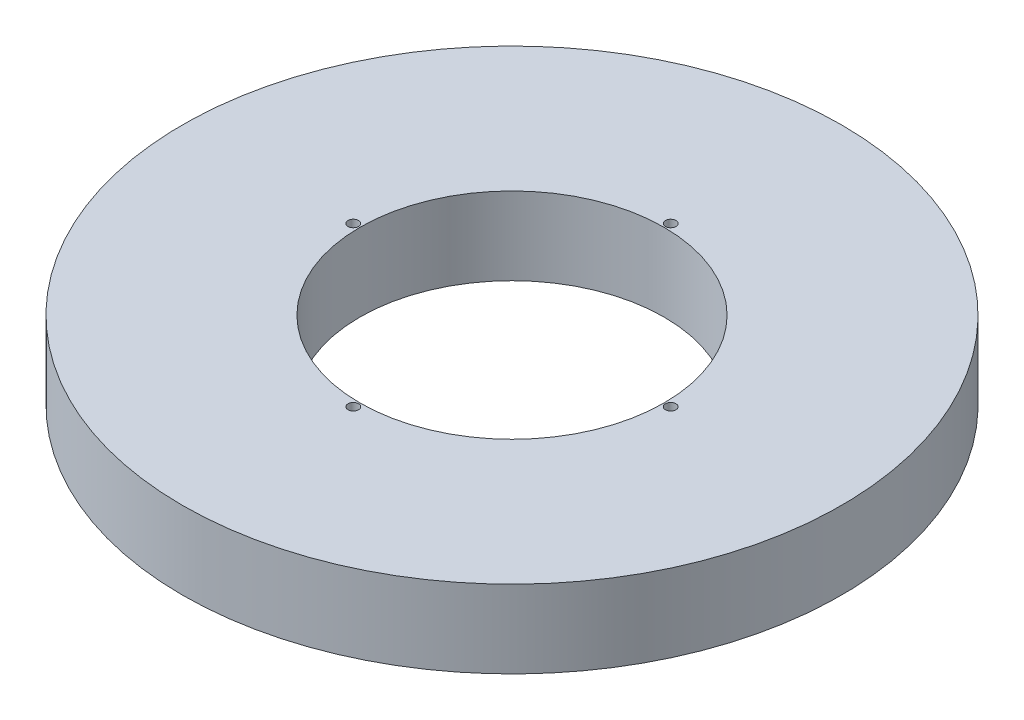
ISO-10303-21;
HEADER;
FILE_DESCRIPTION(('STEP AP214'),'2;1');
FILE_NAME('part.step','',(''),(''),'','','');
FILE_SCHEMA(('AUTOMOTIVE_DESIGN { 1 0 10303 214 1 1 1 1 }'));
ENDSEC;
DATA;
#1=APPLICATION_CONTEXT('core data for automotive mechanical design processes');
#2=APPLICATION_PROTOCOL_DEFINITION('international standard','automotive_design',2000,#1);
#3=PRODUCT_CONTEXT('',#1,'mechanical');
#4=PRODUCT('Part','Part','',(#3));
#5=PRODUCT_RELATED_PRODUCT_CATEGORY('part','',(#4));
#6=PRODUCT_DEFINITION_FORMATION('','',#4);
#7=PRODUCT_DEFINITION_CONTEXT('part definition',#1,'design');
#8=PRODUCT_DEFINITION('design','',#6,#7);
#9=PRODUCT_DEFINITION_SHAPE('','',#8);
#10=(LENGTH_UNIT() NAMED_UNIT(*) SI_UNIT(.MILLI.,.METRE.));
#11=(NAMED_UNIT(*) PLANE_ANGLE_UNIT() SI_UNIT($,.RADIAN.));
#12=(NAMED_UNIT(*) SI_UNIT($,.STERADIAN.) SOLID_ANGLE_UNIT());
#13=UNCERTAINTY_MEASURE_WITH_UNIT(LENGTH_MEASURE(1.E-05),#10,'distance_accuracy_value','');
#14=(GEOMETRIC_REPRESENTATION_CONTEXT(3) GLOBAL_UNCERTAINTY_ASSIGNED_CONTEXT((#13)) GLOBAL_UNIT_ASSIGNED_CONTEXT((#10,
#11,#12)) REPRESENTATION_CONTEXT('',''));
#15=CARTESIAN_POINT('',(0.,0.,0.));
#16=DIRECTION('',(0.,0.,1.));
#17=DIRECTION('',(1.,0.,0.));
#18=AXIS2_PLACEMENT_3D('',#15,#16,#17);
#19=CARTESIAN_POINT('',(0.,23.,0.));
#20=DIRECTION('',(0.,-1.,0.));
#21=DIRECTION('',(0.,0.,-1.));
#22=AXIS2_PLACEMENT_3D('',#19,#20,#21);
#23=CYLINDRICAL_SURFACE('',#22,97.5);
#24=CARTESIAN_POINT('',(0.,23.,0.));
#25=DIRECTION('',(0.,1.,0.));
#26=DIRECTION('',(0.,0.,1.));
#27=AXIS2_PLACEMENT_3D('',#24,#25,#26);
#28=CIRCLE('',#27,97.5);
#29=CARTESIAN_POINT('',(0.,23.,97.5));
#30=VERTEX_POINT('',#29);
#31=EDGE_CURVE('E10',#30,#30,#28,.T.);
#32=ORIENTED_EDGE('',*,*,#31,.F.);
#33=EDGE_LOOP('',(#32));
#34=FACE_BOUND('',#33,.T.);
#35=CARTESIAN_POINT('',(0.,0.,0.));
#36=DIRECTION('',(0.,1.,0.));
#37=DIRECTION('',(0.,0.,1.));
#38=AXIS2_PLACEMENT_3D('',#35,#36,#37);
#39=CIRCLE('',#38,97.5);
#40=CARTESIAN_POINT('',(0.,0.,97.5));
#41=VERTEX_POINT('',#40);
#42=EDGE_CURVE('E37',#41,#41,#39,.T.);
#43=ORIENTED_EDGE('',*,*,#42,.T.);
#44=EDGE_LOOP('',(#43));
#45=FACE_BOUND('',#44,.T.);
#46=ADVANCED_FACE('F40',(#34,#45),#23,.T.);
#47=CARTESIAN_POINT('',(0.,23.,0.));
#48=DIRECTION('',(0.,1.,0.));
#49=DIRECTION('',(0.,0.,1.));
#50=AXIS2_PLACEMENT_3D('',#47,#48,#49);
#51=PLANE('',#50);
#52=CARTESIAN_POINT('',(1.6392450392127E-13,23.,46.949843923721));
#53=DIRECTION('',(0.,1.,0.));
#54=DIRECTION('',(1.,0.,0.));
#55=AXIS2_PLACEMENT_3D('',#52,#53,#54);
#56=CIRCLE('',#55,1.55590810932614);
#57=CARTESIAN_POINT('',(1.55590810932631,23.,46.949843923721));
#58=VERTEX_POINT('',#57);
#59=EDGE_CURVE('E71',#58,#58,#56,.T.);
#60=ORIENTED_EDGE('',*,*,#59,.F.);
#61=EDGE_LOOP('',(#60));
#62=FACE_BOUND('',#61,.T.);
#63=CARTESIAN_POINT('',(46.949843923721,23.,0.));
#64=DIRECTION('',(0.,1.,0.));
#65=DIRECTION('',(0.,0.,-1.));
#66=AXIS2_PLACEMENT_3D('',#63,#64,#65);
#67=CIRCLE('',#66,1.55590810932614);
#68=CARTESIAN_POINT('',(46.949843923721,23.,-1.55590810932614));
#69=VERTEX_POINT('',#68);
#70=EDGE_CURVE('E70',#69,#69,#67,.T.);
#71=ORIENTED_EDGE('',*,*,#70,.F.);
#72=EDGE_LOOP('',(#71));
#73=FACE_BOUND('',#72,.T.);
#74=CARTESIAN_POINT('',(-4.91773511763809E-13,23.,-46.949843923721));
#75=DIRECTION('',(0.,1.,0.));
#76=DIRECTION('',(-1.,0.,0.));
#77=AXIS2_PLACEMENT_3D('',#74,#75,#76);
#78=CIRCLE('',#77,1.55590810932614);
#79=CARTESIAN_POINT('',(-1.55590810932663,23.,-46.949843923721));
#80=VERTEX_POINT('',#79);
#81=EDGE_CURVE('E61',#80,#80,#78,.T.);
#82=ORIENTED_EDGE('',*,*,#81,.F.);
#83=EDGE_LOOP('',(#82));
#84=FACE_BOUND('',#83,.T.);
#85=CARTESIAN_POINT('',(-46.949843923721,23.,0.));
#86=DIRECTION('',(0.,1.,0.));
#87=DIRECTION('',(0.,0.,1.));
#88=AXIS2_PLACEMENT_3D('',#85,#86,#87);
#89=CIRCLE('',#88,1.55590810932614);
#90=CARTESIAN_POINT('',(-46.949843923721,23.,1.55590810932614));
#91=VERTEX_POINT('',#90);
#92=EDGE_CURVE('E54',#91,#91,#89,.T.);
#93=ORIENTED_EDGE('',*,*,#92,.F.);
#94=EDGE_LOOP('',(#93));
#95=FACE_BOUND('',#94,.T.);
#96=CARTESIAN_POINT('',(0.,23.,0.));
#97=DIRECTION('',(0.,1.,0.));
#98=DIRECTION('',(0.,0.,1.));
#99=AXIS2_PLACEMENT_3D('',#96,#97,#98);
#100=CIRCLE('',#99,45.);
#101=CARTESIAN_POINT('',(0.,23.,45.));
#102=VERTEX_POINT('',#101);
#103=EDGE_CURVE('E50',#102,#102,#100,.T.);
#104=ORIENTED_EDGE('',*,*,#103,.F.);
#105=EDGE_LOOP('',(#104));
#106=FACE_BOUND('',#105,.T.);
#107=ORIENTED_EDGE('',*,*,#31,.T.);
#108=EDGE_LOOP('',(#107));
#109=FACE_BOUND('',#108,.T.);
#110=ADVANCED_FACE('F86',(#62,#73,#84,#95,#106,#109),#51,.T.);
#111=CARTESIAN_POINT('',(0.,0.,0.));
#112=DIRECTION('',(0.,1.,0.));
#113=DIRECTION('',(0.,0.,1.));
#114=AXIS2_PLACEMENT_3D('',#111,#112,#113);
#115=PLANE('',#114);
#116=CARTESIAN_POINT('',(0.,0.,0.));
#117=DIRECTION('',(0.,1.,0.));
#118=DIRECTION('',(0.,0.,1.));
#119=AXIS2_PLACEMENT_3D('',#116,#117,#118);
#120=CIRCLE('',#119,45.);
#121=CARTESIAN_POINT('',(0.,0.,45.));
#122=VERTEX_POINT('',#121);
#123=EDGE_CURVE('E47',#122,#122,#120,.T.);
#124=ORIENTED_EDGE('',*,*,#123,.T.);
#125=EDGE_LOOP('',(#124));
#126=FACE_BOUND('',#125,.T.);
#127=ORIENTED_EDGE('',*,*,#42,.F.);
#128=EDGE_LOOP('',(#127));
#129=FACE_BOUND('',#128,.T.);
#130=ADVANCED_FACE('F93',(#126,#129),#115,.F.);
#131=CARTESIAN_POINT('',(0.,23.,0.));
#132=DIRECTION('',(0.,-1.,0.));
#133=DIRECTION('',(0.,0.,-1.));
#134=AXIS2_PLACEMENT_3D('',#131,#132,#133);
#135=CYLINDRICAL_SURFACE('',#134,45.);
#136=ORIENTED_EDGE('',*,*,#103,.T.);
#137=EDGE_LOOP('',(#136));
#138=FACE_BOUND('',#137,.T.);
#139=ORIENTED_EDGE('',*,*,#123,.F.);
#140=EDGE_LOOP('',(#139));
#141=FACE_BOUND('',#140,.T.);
#142=ADVANCED_FACE('F101',(#138,#141),#135,.F.);
#143=CARTESIAN_POINT('',(-46.949843923721,4.63825307948126,0.));
#144=DIRECTION('',(0.,1.,0.));
#145=DIRECTION('',(0.,0.,1.));
#146=AXIS2_PLACEMENT_3D('',#143,#144,#145);
#147=CYLINDRICAL_SURFACE('',#146,1.55590810932614);
#148=CARTESIAN_POINT('',(-46.949843923721,4.63825307948126,0.));
#149=DIRECTION('',(0.,1.,0.));
#150=DIRECTION('',(0.,0.,1.));
#151=AXIS2_PLACEMENT_3D('',#148,#149,#150);
#152=CIRCLE('',#151,1.55590810932614);
#153=CARTESIAN_POINT('',(-46.949843923721,4.63825307948126,1.55590810932614));
#154=VERTEX_POINT('',#153);
#155=EDGE_CURVE('E55',#154,#154,#152,.T.);
#156=ORIENTED_EDGE('',*,*,#155,.F.);
#157=EDGE_LOOP('',(#156));
#158=FACE_BOUND('',#157,.T.);
#159=ORIENTED_EDGE('',*,*,#92,.T.);
#160=EDGE_LOOP('',(#159));
#161=FACE_BOUND('',#160,.T.);
#162=ADVANCED_FACE('F102',(#158,#161),#147,.F.);
#163=CARTESIAN_POINT('',(-46.949843923721,4.63825307948126,0.));
#164=DIRECTION('',(0.,1.,0.));
#165=DIRECTION('',(0.,0.,1.));
#166=AXIS2_PLACEMENT_3D('',#163,#164,#165);
#167=PLANE('',#166);
#168=ORIENTED_EDGE('',*,*,#155,.T.);
#169=EDGE_LOOP('',(#168));
#170=FACE_BOUND('',#169,.T.);
#171=ADVANCED_FACE('F133',(#170),#167,.T.);
#172=CARTESIAN_POINT('',(-4.91773511763809E-13,4.63825307948126,-46.949843923721));
#173=DIRECTION('',(0.,1.,0.));
#174=DIRECTION('',(0.,0.,1.));
#175=AXIS2_PLACEMENT_3D('',#172,#173,#174);
#176=CYLINDRICAL_SURFACE('',#175,1.55590810932614);
#177=CARTESIAN_POINT('',(-4.91773511763809E-13,4.63825307948126,-46.949843923721));
#178=DIRECTION('',(0.,1.,0.));
#179=DIRECTION('',(-1.,0.,0.));
#180=AXIS2_PLACEMENT_3D('',#177,#178,#179);
#181=CIRCLE('',#180,1.55590810932614);
#182=CARTESIAN_POINT('',(-1.55590810932663,4.63825307948126,-46.949843923721));
#183=VERTEX_POINT('',#182);
#184=EDGE_CURVE('E63',#183,#183,#181,.T.);
#185=ORIENTED_EDGE('',*,*,#184,.F.);
#186=EDGE_LOOP('',(#185));
#187=FACE_BOUND('',#186,.T.);
#188=ORIENTED_EDGE('',*,*,#81,.T.);
#189=EDGE_LOOP('',(#188));
#190=FACE_BOUND('',#189,.T.);
#191=ADVANCED_FACE('F142',(#187,#190),#176,.F.);
#192=CARTESIAN_POINT('',(-4.91773511763809E-13,4.63825307948126,-46.949843923721));
#193=DIRECTION('',(0.,1.,0.));
#194=DIRECTION('',(-1.,0.,0.));
#195=AXIS2_PLACEMENT_3D('',#192,#193,#194);
#196=PLANE('',#195);
#197=ORIENTED_EDGE('',*,*,#184,.T.);
#198=EDGE_LOOP('',(#197));
#199=FACE_BOUND('',#198,.T.);
#200=ADVANCED_FACE('F156',(#199),#196,.T.);
#201=CARTESIAN_POINT('',(46.949843923721,4.63825307948126,0.));
#202=DIRECTION('',(0.,1.,0.));
#203=DIRECTION('',(0.,0.,1.));
#204=AXIS2_PLACEMENT_3D('',#201,#202,#203);
#205=CYLINDRICAL_SURFACE('',#204,1.55590810932614);
#206=CARTESIAN_POINT('',(46.949843923721,4.63825307948126,0.));
#207=DIRECTION('',(0.,1.,0.));
#208=DIRECTION('',(0.,0.,-1.));
#209=AXIS2_PLACEMENT_3D('',#206,#207,#208);
#210=CIRCLE('',#209,1.55590810932614);
#211=CARTESIAN_POINT('',(46.949843923721,4.63825307948126,-1.55590810932614));
#212=VERTEX_POINT('',#211);
#213=EDGE_CURVE('E69',#212,#212,#210,.T.);
#214=ORIENTED_EDGE('',*,*,#213,.F.);
#215=EDGE_LOOP('',(#214));
#216=FACE_BOUND('',#215,.T.);
#217=ORIENTED_EDGE('',*,*,#70,.T.);
#218=EDGE_LOOP('',(#217));
#219=FACE_BOUND('',#218,.T.);
#220=ADVANCED_FACE('F164',(#216,#219),#205,.F.);
#221=CARTESIAN_POINT('',(46.949843923721,4.63825307948126,0.));
#222=DIRECTION('',(0.,1.,0.));
#223=DIRECTION('',(0.,0.,-1.));
#224=AXIS2_PLACEMENT_3D('',#221,#222,#223);
#225=PLANE('',#224);
#226=ORIENTED_EDGE('',*,*,#213,.T.);
#227=EDGE_LOOP('',(#226));
#228=FACE_BOUND('',#227,.T.);
#229=ADVANCED_FACE('F83',(#228),#225,.T.);
#230=CARTESIAN_POINT('',(1.6392450392127E-13,4.63825307948126,46.949843923721));
#231=DIRECTION('',(0.,1.,0.));
#232=DIRECTION('',(0.,0.,1.));
#233=AXIS2_PLACEMENT_3D('',#230,#231,#232);
#234=CYLINDRICAL_SURFACE('',#233,1.55590810932614);
#235=CARTESIAN_POINT('',(1.6392450392127E-13,4.63825307948126,46.949843923721));
#236=DIRECTION('',(0.,1.,0.));
#237=DIRECTION('',(1.,0.,0.));
#238=AXIS2_PLACEMENT_3D('',#235,#236,#237);
#239=CIRCLE('',#238,1.55590810932614);
#240=CARTESIAN_POINT('',(1.55590810932631,4.63825307948126,46.949843923721));
#241=VERTEX_POINT('',#240);
#242=EDGE_CURVE('E59',#241,#241,#239,.T.);
#243=ORIENTED_EDGE('',*,*,#242,.F.);
#244=EDGE_LOOP('',(#243));
#245=FACE_BOUND('',#244,.T.);
#246=ORIENTED_EDGE('',*,*,#59,.T.);
#247=EDGE_LOOP('',(#246));
#248=FACE_BOUND('',#247,.T.);
#249=ADVANCED_FACE('F81',(#245,#248),#234,.F.);
#250=CARTESIAN_POINT('',(1.6392450392127E-13,4.63825307948126,46.949843923721));
#251=DIRECTION('',(0.,1.,0.));
#252=DIRECTION('',(1.,0.,0.));
#253=AXIS2_PLACEMENT_3D('',#250,#251,#252);
#254=PLANE('',#253);
#255=ORIENTED_EDGE('',*,*,#242,.T.);
#256=EDGE_LOOP('',(#255));
#257=FACE_BOUND('',#256,.T.);
#258=ADVANCED_FACE('F78',(#257),#254,.T.);
#259=CLOSED_SHELL('',(#46,#110,#130,#142,#162,#171,#191,#200,#220,#229,#249,#258));
#260=MANIFOLD_SOLID_BREP('B2',#259);
#261=ADVANCED_BREP_SHAPE_REPRESENTATION('',(#18,#260),#14);
#262=SHAPE_DEFINITION_REPRESENTATION(#9,#261);
ENDSEC;
END-ISO-10303-21;
